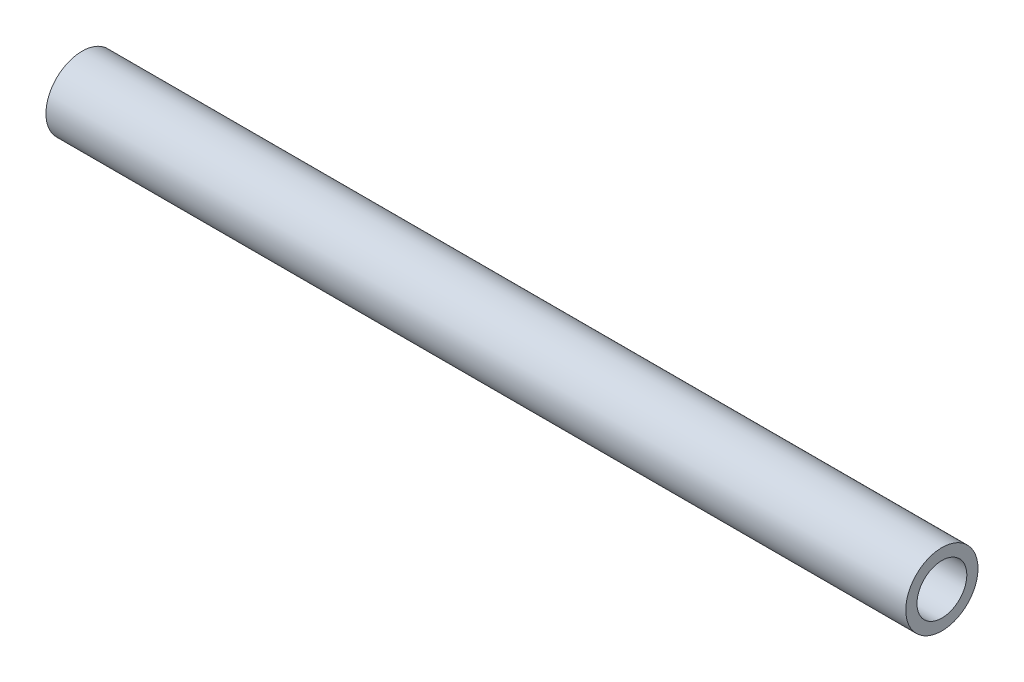
ISO-10303-21;
HEADER;
FILE_DESCRIPTION(('STEP AP214'),'2;1');
FILE_NAME('part.step','',(''),(''),'','','');
FILE_SCHEMA(('AUTOMOTIVE_DESIGN { 1 0 10303 214 1 1 1 1 }'));
ENDSEC;
DATA;
#1=APPLICATION_CONTEXT('core data for automotive mechanical design processes');
#2=APPLICATION_PROTOCOL_DEFINITION('international standard','automotive_design',2000,#1);
#3=PRODUCT_CONTEXT('',#1,'mechanical');
#4=PRODUCT('Part','Part','',(#3));
#5=PRODUCT_RELATED_PRODUCT_CATEGORY('part','',(#4));
#6=PRODUCT_DEFINITION_FORMATION('','',#4);
#7=PRODUCT_DEFINITION_CONTEXT('part definition',#1,'design');
#8=PRODUCT_DEFINITION('design','',#6,#7);
#9=PRODUCT_DEFINITION_SHAPE('','',#8);
#10=(LENGTH_UNIT() NAMED_UNIT(*) SI_UNIT(.MILLI.,.METRE.));
#11=(NAMED_UNIT(*) PLANE_ANGLE_UNIT() SI_UNIT($,.RADIAN.));
#12=(NAMED_UNIT(*) SI_UNIT($,.STERADIAN.) SOLID_ANGLE_UNIT());
#13=UNCERTAINTY_MEASURE_WITH_UNIT(LENGTH_MEASURE(1.E-05),#10,'distance_accuracy_value','');
#14=(GEOMETRIC_REPRESENTATION_CONTEXT(3) GLOBAL_UNCERTAINTY_ASSIGNED_CONTEXT((#13)) GLOBAL_UNIT_ASSIGNED_CONTEXT((#10,
#11,#12)) REPRESENTATION_CONTEXT('',''));
#15=CARTESIAN_POINT('',(0.,0.,0.));
#16=DIRECTION('',(0.,0.,1.));
#17=DIRECTION('',(1.,0.,0.));
#18=AXIS2_PLACEMENT_3D('',#15,#16,#17);
#19=CARTESIAN_POINT('',(-254.,0.,0.));
#20=DIRECTION('',(1.,0.,0.));
#21=DIRECTION('',(0.,0.,-1.));
#22=AXIS2_PLACEMENT_3D('',#19,#20,#21);
#23=CYLINDRICAL_SURFACE('',#22,10.668);
#24=CARTESIAN_POINT('',(-254.,0.,0.));
#25=DIRECTION('',(1.,0.,0.));
#26=DIRECTION('',(0.,0.,-1.));
#27=AXIS2_PLACEMENT_3D('',#24,#25,#26);
#28=CIRCLE('',#27,10.668);
#29=CARTESIAN_POINT('',(-254.,0.,-10.668));
#30=VERTEX_POINT('',#29);
#31=EDGE_CURVE('E10',#30,#30,#28,.T.);
#32=ORIENTED_EDGE('',*,*,#31,.T.);
#33=EDGE_LOOP('',(#32));
#34=FACE_BOUND('',#33,.T.);
#35=CARTESIAN_POINT('',(0.,0.,0.));
#36=DIRECTION('',(1.,0.,0.));
#37=DIRECTION('',(0.,0.,-1.));
#38=AXIS2_PLACEMENT_3D('',#35,#36,#37);
#39=CIRCLE('',#38,10.668);
#40=CARTESIAN_POINT('',(0.,0.,-10.668));
#41=VERTEX_POINT('',#40);
#42=EDGE_CURVE('E34',#41,#41,#39,.T.);
#43=ORIENTED_EDGE('',*,*,#42,.F.);
#44=EDGE_LOOP('',(#43));
#45=FACE_BOUND('',#44,.T.);
#46=ADVANCED_FACE('F31',(#34,#45),#23,.T.);
#47=CARTESIAN_POINT('',(-254.,0.,0.));
#48=DIRECTION('',(1.,0.,0.));
#49=DIRECTION('',(0.,0.,-1.));
#50=AXIS2_PLACEMENT_3D('',#47,#48,#49);
#51=PLANE('',#50);
#52=CARTESIAN_POINT('',(-254.,0.,0.));
#53=DIRECTION('',(1.,0.,0.));
#54=DIRECTION('',(0.,0.,-1.));
#55=AXIS2_PLACEMENT_3D('',#52,#53,#54);
#56=CIRCLE('',#55,7.366);
#57=CARTESIAN_POINT('',(-254.,0.,-7.366));
#58=VERTEX_POINT('',#57);
#59=EDGE_CURVE('E41',#58,#58,#56,.T.);
#60=ORIENTED_EDGE('',*,*,#59,.T.);
#61=EDGE_LOOP('',(#60));
#62=FACE_BOUND('',#61,.T.);
#63=ORIENTED_EDGE('',*,*,#31,.F.);
#64=EDGE_LOOP('',(#63));
#65=FACE_BOUND('',#64,.T.);
#66=ADVANCED_FACE('F49',(#62,#65),#51,.F.);
#67=CARTESIAN_POINT('',(0.,0.,0.));
#68=DIRECTION('',(1.,0.,0.));
#69=DIRECTION('',(0.,0.,-1.));
#70=AXIS2_PLACEMENT_3D('',#67,#68,#69);
#71=PLANE('',#70);
#72=CARTESIAN_POINT('',(0.,0.,0.));
#73=DIRECTION('',(1.,0.,0.));
#74=DIRECTION('',(0.,0.,-1.));
#75=AXIS2_PLACEMENT_3D('',#72,#73,#74);
#76=CIRCLE('',#75,7.366);
#77=CARTESIAN_POINT('',(0.,0.,-7.366));
#78=VERTEX_POINT('',#77);
#79=EDGE_CURVE('E43',#78,#78,#76,.T.);
#80=ORIENTED_EDGE('',*,*,#79,.F.);
#81=EDGE_LOOP('',(#80));
#82=FACE_BOUND('',#81,.T.);
#83=ORIENTED_EDGE('',*,*,#42,.T.);
#84=EDGE_LOOP('',(#83));
#85=FACE_BOUND('',#84,.T.);
#86=ADVANCED_FACE('F55',(#82,#85),#71,.T.);
#87=CARTESIAN_POINT('',(-254.,0.,0.));
#88=DIRECTION('',(1.,0.,0.));
#89=DIRECTION('',(0.,0.,-1.));
#90=AXIS2_PLACEMENT_3D('',#87,#88,#89);
#91=CYLINDRICAL_SURFACE('',#90,7.366);
#92=ORIENTED_EDGE('',*,*,#59,.F.);
#93=EDGE_LOOP('',(#92));
#94=FACE_BOUND('',#93,.T.);
#95=ORIENTED_EDGE('',*,*,#79,.T.);
#96=EDGE_LOOP('',(#95));
#97=FACE_BOUND('',#96,.T.);
#98=ADVANCED_FACE('F52',(#94,#97),#91,.F.);
#99=CLOSED_SHELL('',(#46,#66,#86,#98));
#100=MANIFOLD_SOLID_BREP('B2',#99);
#101=ADVANCED_BREP_SHAPE_REPRESENTATION('',(#18,#100),#14);
#102=SHAPE_DEFINITION_REPRESENTATION(#9,#101);
ENDSEC;
END-ISO-10303-21;
